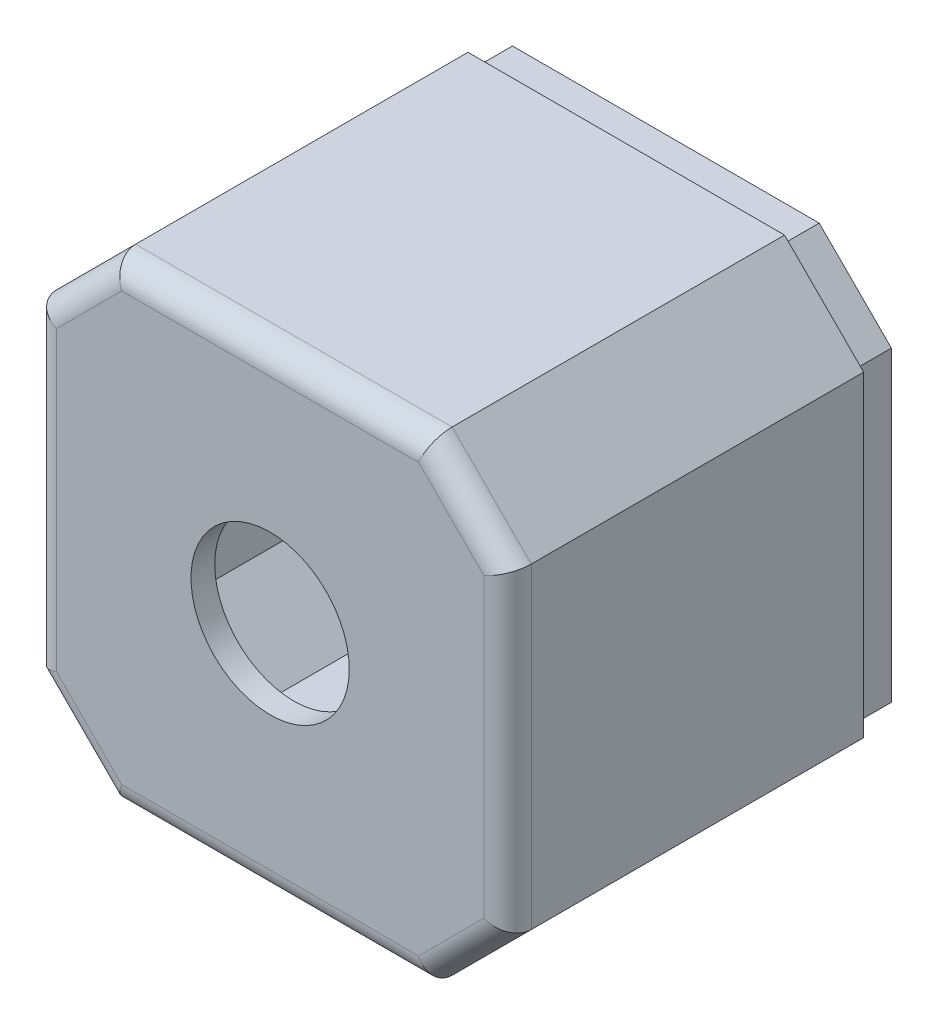
ISO-10303-21;
HEADER;
FILE_DESCRIPTION(('STEP AP214'),'2;1');
FILE_NAME('part.step','',(''),(''),'','','');
FILE_SCHEMA(('AUTOMOTIVE_DESIGN { 1 0 10303 214 1 1 1 1 }'));
ENDSEC;
DATA;
#1=APPLICATION_CONTEXT('core data for automotive mechanical design processes');
#2=APPLICATION_PROTOCOL_DEFINITION('international standard','automotive_design',2000,#1);
#3=PRODUCT_CONTEXT('',#1,'mechanical');
#4=PRODUCT('Part','Part','',(#3));
#5=PRODUCT_RELATED_PRODUCT_CATEGORY('part','',(#4));
#6=PRODUCT_DEFINITION_FORMATION('','',#4);
#7=PRODUCT_DEFINITION_CONTEXT('part definition',#1,'design');
#8=PRODUCT_DEFINITION('design','',#6,#7);
#9=PRODUCT_DEFINITION_SHAPE('','',#8);
#10=(LENGTH_UNIT() NAMED_UNIT(*) SI_UNIT(.MILLI.,.METRE.));
#11=(NAMED_UNIT(*) PLANE_ANGLE_UNIT() SI_UNIT($,.RADIAN.));
#12=(NAMED_UNIT(*) SI_UNIT($,.STERADIAN.) SOLID_ANGLE_UNIT());
#13=UNCERTAINTY_MEASURE_WITH_UNIT(LENGTH_MEASURE(1.E-05),#10,'distance_accuracy_value','');
#14=(GEOMETRIC_REPRESENTATION_CONTEXT(3) GLOBAL_UNCERTAINTY_ASSIGNED_CONTEXT((#13)) GLOBAL_UNIT_ASSIGNED_CONTEXT((#10,
#11,#12)) REPRESENTATION_CONTEXT('',''));
#15=CARTESIAN_POINT('',(0.,0.,0.));
#16=DIRECTION('',(0.,0.,1.));
#17=DIRECTION('',(1.,0.,0.));
#18=AXIS2_PLACEMENT_3D('',#15,#16,#17);
#19=CARTESIAN_POINT('',(0.,0.,0.));
#20=DIRECTION('',(0.,0.,-1.));
#21=DIRECTION('',(-1.,0.,0.));
#22=AXIS2_PLACEMENT_3D('',#19,#20,#21);
#23=PLANE('',#22);
#24=DIRECTION('',(-0.707106781186549,-0.707106781186546,0.));
#25=VECTOR('',#24,1.);
#26=CARTESIAN_POINT('',(-22.8786796564404,22.8786796564405,0.));
#27=LINE('',#26,#25);
#28=CARTESIAN_POINT('',(3.,48.7573593128807,0.));
#29=VERTEX_POINT('',#28);
#30=CARTESIAN_POINT('',(11.2426406871193,57.,0.));
#31=VERTEX_POINT('',#30);
#32=EDGE_CURVE('E369',#29,#31,#27,.F.);
#33=ORIENTED_EDGE('',*,*,#32,.F.);
#34=DIRECTION('',(0.,-1.,0.));
#35=VECTOR('',#34,1.);
#36=CARTESIAN_POINT('',(3.,0.,0.));
#37=LINE('',#36,#35);
#38=CARTESIAN_POINT('',(3.,11.2426406871193,0.));
#39=VERTEX_POINT('',#38);
#40=EDGE_CURVE('E324',#29,#39,#37,.T.);
#41=ORIENTED_EDGE('',*,*,#40,.T.);
#42=DIRECTION('',(0.707106781186546,-0.707106781186549,0.));
#43=VECTOR('',#42,1.);
#44=CARTESIAN_POINT('',(7.12132034355967,7.12132034355964,0.));
#45=LINE('',#44,#43);
#46=CARTESIAN_POINT('',(11.2426406871193,3.,0.));
#47=VERTEX_POINT('',#46);
#48=EDGE_CURVE('E375',#47,#39,#45,.F.);
#49=ORIENTED_EDGE('',*,*,#48,.F.);
#50=DIRECTION('',(1.,0.,0.));
#51=VECTOR('',#50,1.);
#52=CARTESIAN_POINT('',(0.,3.,0.));
#53=LINE('',#52,#51);
#54=CARTESIAN_POINT('',(48.7573593128807,3.,0.));
#55=VERTEX_POINT('',#54);
#56=EDGE_CURVE('E373',#47,#55,#53,.T.);
#57=ORIENTED_EDGE('',*,*,#56,.T.);
#58=DIRECTION('',(0.707106781186549,0.707106781186546,0.));
#59=VECTOR('',#58,1.);
#60=CARTESIAN_POINT('',(22.8786796564402,-22.8786796564403,0.));
#61=LINE('',#60,#59);
#62=CARTESIAN_POINT('',(57.,11.2426406871193,0.));
#63=VERTEX_POINT('',#62);
#64=EDGE_CURVE('E380',#63,#55,#61,.F.);
#65=ORIENTED_EDGE('',*,*,#64,.F.);
#66=DIRECTION('',(0.,1.,0.));
#67=VECTOR('',#66,1.);
#68=CARTESIAN_POINT('',(57.,0.,0.));
#69=LINE('',#68,#67);
#70=CARTESIAN_POINT('',(57.,48.7573593128807,0.));
#71=VERTEX_POINT('',#70);
#72=EDGE_CURVE('E378',#63,#71,#69,.T.);
#73=ORIENTED_EDGE('',*,*,#72,.T.);
#74=DIRECTION('',(-0.707106781186547,0.707106781186548,0.));
#75=VECTOR('',#74,1.);
#76=CARTESIAN_POINT('',(52.8786796564404,52.8786796564403,0.));
#77=LINE('',#76,#75);
#78=CARTESIAN_POINT('',(48.7573593128807,57.,0.));
#79=VERTEX_POINT('',#78);
#80=EDGE_CURVE('E337',#79,#71,#77,.F.);
#81=ORIENTED_EDGE('',*,*,#80,.F.);
#82=DIRECTION('',(-1.,0.,0.));
#83=VECTOR('',#82,1.);
#84=CARTESIAN_POINT('',(0.,57.,0.));
#85=LINE('',#84,#83);
#86=EDGE_CURVE('E331',#79,#31,#85,.T.);
#87=ORIENTED_EDGE('',*,*,#86,.T.);
#88=EDGE_LOOP('',(#33,#41,#49,#57,#65,#73,#81,#87));
#89=FACE_BOUND('',#88,.T.);
#90=DIRECTION('',(-1.,0.,0.));
#91=VECTOR('',#90,1.);
#92=CARTESIAN_POINT('',(49.3786796564403,1.5,0.));
#93=LINE('',#92,#91);
#94=CARTESIAN_POINT('',(49.3786796564403,1.5,0.));
#95=VERTEX_POINT('',#94);
#96=CARTESIAN_POINT('',(10.6213203435596,1.5,0.));
#97=VERTEX_POINT('',#96);
#98=EDGE_CURVE('E258',#95,#97,#93,.T.);
#99=ORIENTED_EDGE('',*,*,#98,.T.);
#100=DIRECTION('',(-0.707106781186546,0.707106781186549,0.));
#101=VECTOR('',#100,1.);
#102=CARTESIAN_POINT('',(10.6213203435596,1.5,0.));
#103=LINE('',#102,#101);
#104=CARTESIAN_POINT('',(1.5,10.6213203435597,0.));
#105=VERTEX_POINT('',#104);
#106=EDGE_CURVE('E278',#97,#105,#103,.T.);
#107=ORIENTED_EDGE('',*,*,#106,.T.);
#108=DIRECTION('',(0.,1.,0.));
#109=VECTOR('',#108,1.);
#110=CARTESIAN_POINT('',(1.5,10.6213203435597,0.));
#111=LINE('',#110,#109);
#112=CARTESIAN_POINT('',(1.5,49.3786796564404,0.));
#113=VERTEX_POINT('',#112);
#114=EDGE_CURVE('E238',#105,#113,#111,.T.);
#115=ORIENTED_EDGE('',*,*,#114,.T.);
#116=DIRECTION('',(0.707106781186549,0.707106781186546,0.));
#117=VECTOR('',#116,1.);
#118=CARTESIAN_POINT('',(1.5,49.3786796564404,0.));
#119=LINE('',#118,#117);
#120=CARTESIAN_POINT('',(10.6213203435597,58.5,0.));
#121=VERTEX_POINT('',#120);
#122=EDGE_CURVE('E63',#113,#121,#119,.T.);
#123=ORIENTED_EDGE('',*,*,#122,.T.);
#124=DIRECTION('',(1.,0.,0.));
#125=VECTOR('',#124,1.);
#126=CARTESIAN_POINT('',(10.6213203435597,58.5,0.));
#127=LINE('',#126,#125);
#128=CARTESIAN_POINT('',(49.3786796564404,58.5,0.));
#129=VERTEX_POINT('',#128);
#130=EDGE_CURVE('E282',#121,#129,#127,.T.);
#131=ORIENTED_EDGE('',*,*,#130,.T.);
#132=DIRECTION('',(0.707106781186547,-0.707106781186548,0.));
#133=VECTOR('',#132,1.);
#134=CARTESIAN_POINT('',(49.3786796564404,58.5,0.));
#135=LINE('',#134,#133);
#136=CARTESIAN_POINT('',(58.5,49.3786796564403,0.));
#137=VERTEX_POINT('',#136);
#138=EDGE_CURVE('E285',#129,#137,#135,.T.);
#139=ORIENTED_EDGE('',*,*,#138,.T.);
#140=DIRECTION('',(0.,-1.,0.));
#141=VECTOR('',#140,1.);
#142=CARTESIAN_POINT('',(58.5,49.3786796564403,0.));
#143=LINE('',#142,#141);
#144=CARTESIAN_POINT('',(58.5,10.6213203435596,0.));
#145=VERTEX_POINT('',#144);
#146=EDGE_CURVE('E288',#137,#145,#143,.T.);
#147=ORIENTED_EDGE('',*,*,#146,.T.);
#148=DIRECTION('',(-0.707106781186549,-0.707106781186546,0.));
#149=VECTOR('',#148,1.);
#150=CARTESIAN_POINT('',(58.5,10.6213203435596,0.));
#151=LINE('',#150,#149);
#152=EDGE_CURVE('E261',#145,#95,#151,.T.);
#153=ORIENTED_EDGE('',*,*,#152,.T.);
#154=EDGE_LOOP('',(#99,#107,#115,#123,#131,#139,#147,#153));
#155=FACE_BOUND('',#154,.T.);
#156=ADVANCED_FACE('F46',(#89,#155),#23,.T.);
#157=CARTESIAN_POINT('',(0.,0.,50.));
#158=DIRECTION('',(1.,0.,0.));
#159=DIRECTION('',(0.,0.,-1.));
#160=AXIS2_PLACEMENT_3D('',#157,#158,#159);
#161=PLANE('',#160);
#162=DIRECTION('',(0.,1.,0.));
#163=VECTOR('',#162,1.);
#164=CARTESIAN_POINT('',(0.,10.,5.));
#165=LINE('',#164,#163);
#166=CARTESIAN_POINT('',(0.,10.,5.));
#167=VERTEX_POINT('',#166);
#168=CARTESIAN_POINT('',(0.,50.,5.));
#169=VERTEX_POINT('',#168);
#170=EDGE_CURVE('E307',#167,#169,#165,.T.);
#171=ORIENTED_EDGE('',*,*,#170,.F.);
#172=DIRECTION('',(0.,0.,1.));
#173=VECTOR('',#172,1.);
#174=CARTESIAN_POINT('',(0.,10.,50.));
#175=LINE('',#174,#173);
#176=CARTESIAN_POINT('',(0.,10.,47.));
#177=VERTEX_POINT('',#176);
#178=EDGE_CURVE('E387',#167,#177,#175,.T.);
#179=ORIENTED_EDGE('',*,*,#178,.T.);
#180=DIRECTION('',(0.,-1.,0.));
#181=VECTOR('',#180,1.);
#182=CARTESIAN_POINT('',(0.,0.,47.));
#183=LINE('',#182,#181);
#184=CARTESIAN_POINT('',(0.,50.,47.));
#185=VERTEX_POINT('',#184);
#186=EDGE_CURVE('E13',#177,#185,#183,.F.);
#187=ORIENTED_EDGE('',*,*,#186,.T.);
#188=DIRECTION('',(0.,0.,-1.));
#189=VECTOR('',#188,1.);
#190=CARTESIAN_POINT('',(0.,50.,50.));
#191=LINE('',#190,#189);
#192=EDGE_CURVE('E389',#185,#169,#191,.T.);
#193=ORIENTED_EDGE('',*,*,#192,.T.);
#194=EDGE_LOOP('',(#171,#179,#187,#193));
#195=FACE_BOUND('',#194,.T.);
#196=ADVANCED_FACE('F528',(#195),#161,.F.);
#197=CARTESIAN_POINT('',(0.,0.,50.));
#198=DIRECTION('',(0.,1.,0.));
#199=DIRECTION('',(0.,0.,1.));
#200=AXIS2_PLACEMENT_3D('',#197,#198,#199);
#201=PLANE('',#200);
#202=DIRECTION('',(-1.,0.,0.));
#203=VECTOR('',#202,1.);
#204=CARTESIAN_POINT('',(50.,0.,5.));
#205=LINE('',#204,#203);
#206=CARTESIAN_POINT('',(50.,0.,5.));
#207=VERTEX_POINT('',#206);
#208=CARTESIAN_POINT('',(9.99999999999999,0.,5.));
#209=VERTEX_POINT('',#208);
#210=EDGE_CURVE('E318',#207,#209,#205,.T.);
#211=ORIENTED_EDGE('',*,*,#210,.F.);
#212=DIRECTION('',(0.,0.,1.));
#213=VECTOR('',#212,1.);
#214=CARTESIAN_POINT('',(50.,0.,50.));
#215=LINE('',#214,#213);
#216=CARTESIAN_POINT('',(50.,0.,47.));
#217=VERTEX_POINT('',#216);
#218=EDGE_CURVE('E397',#207,#217,#215,.T.);
#219=ORIENTED_EDGE('',*,*,#218,.T.);
#220=DIRECTION('',(1.,0.,0.));
#221=VECTOR('',#220,1.);
#222=CARTESIAN_POINT('',(0.,0.,47.));
#223=LINE('',#222,#221);
#224=CARTESIAN_POINT('',(9.99999999999999,0.,47.));
#225=VERTEX_POINT('',#224);
#226=EDGE_CURVE('E437',#217,#225,#223,.F.);
#227=ORIENTED_EDGE('',*,*,#226,.T.);
#228=DIRECTION('',(0.,0.,-1.));
#229=VECTOR('',#228,1.);
#230=CARTESIAN_POINT('',(9.99999999999999,0.,50.));
#231=LINE('',#230,#229);
#232=EDGE_CURVE('E399',#225,#209,#231,.T.);
#233=ORIENTED_EDGE('',*,*,#232,.T.);
#234=EDGE_LOOP('',(#211,#219,#227,#233));
#235=FACE_BOUND('',#234,.T.);
#236=ADVANCED_FACE('F512',(#235),#201,.F.);
#237=CARTESIAN_POINT('',(60.,0.,50.));
#238=DIRECTION('',(-1.,0.,0.));
#239=DIRECTION('',(0.,-1.,0.));
#240=AXIS2_PLACEMENT_3D('',#237,#238,#239);
#241=PLANE('',#240);
#242=DIRECTION('',(0.,-1.,0.));
#243=VECTOR('',#242,1.);
#244=CARTESIAN_POINT('',(60.,50.,5.));
#245=LINE('',#244,#243);
#246=CARTESIAN_POINT('',(60.,50.,5.));
#247=VERTEX_POINT('',#246);
#248=CARTESIAN_POINT('',(60.,10.,5.));
#249=VERTEX_POINT('',#248);
#250=EDGE_CURVE('E314',#247,#249,#245,.T.);
#251=ORIENTED_EDGE('',*,*,#250,.F.);
#252=DIRECTION('',(0.,0.,1.));
#253=VECTOR('',#252,1.);
#254=CARTESIAN_POINT('',(60.,50.,50.));
#255=LINE('',#254,#253);
#256=CARTESIAN_POINT('',(60.,50.,47.));
#257=VERTEX_POINT('',#256);
#258=EDGE_CURVE('E402',#247,#257,#255,.T.);
#259=ORIENTED_EDGE('',*,*,#258,.T.);
#260=DIRECTION('',(0.,1.,0.));
#261=VECTOR('',#260,1.);
#262=CARTESIAN_POINT('',(60.,0.,47.));
#263=LINE('',#262,#261);
#264=CARTESIAN_POINT('',(60.,10.,47.));
#265=VERTEX_POINT('',#264);
#266=EDGE_CURVE('E432',#257,#265,#263,.F.);
#267=ORIENTED_EDGE('',*,*,#266,.T.);
#268=DIRECTION('',(0.,0.,-1.));
#269=VECTOR('',#268,1.);
#270=CARTESIAN_POINT('',(60.,10.,50.));
#271=LINE('',#270,#269);
#272=EDGE_CURVE('E404',#265,#249,#271,.T.);
#273=ORIENTED_EDGE('',*,*,#272,.T.);
#274=EDGE_LOOP('',(#251,#259,#267,#273));
#275=FACE_BOUND('',#274,.T.);
#276=ADVANCED_FACE('F479',(#275),#241,.F.);
#277=CARTESIAN_POINT('',(0.,60.,50.));
#278=DIRECTION('',(0.,-1.,0.));
#279=DIRECTION('',(0.,0.,-1.));
#280=AXIS2_PLACEMENT_3D('',#277,#278,#279);
#281=PLANE('',#280);
#282=DIRECTION('',(1.,0.,0.));
#283=VECTOR('',#282,1.);
#284=CARTESIAN_POINT('',(10.,60.,5.));
#285=LINE('',#284,#283);
#286=CARTESIAN_POINT('',(10.,60.,5.));
#287=VERTEX_POINT('',#286);
#288=CARTESIAN_POINT('',(50.,60.,5.));
#289=VERTEX_POINT('',#288);
#290=EDGE_CURVE('E71',#287,#289,#285,.T.);
#291=ORIENTED_EDGE('',*,*,#290,.F.);
#292=DIRECTION('',(0.,0.,1.));
#293=VECTOR('',#292,1.);
#294=CARTESIAN_POINT('',(10.,60.,50.));
#295=LINE('',#294,#293);
#296=CARTESIAN_POINT('',(10.,60.,47.));
#297=VERTEX_POINT('',#296);
#298=EDGE_CURVE('E395',#287,#297,#295,.T.);
#299=ORIENTED_EDGE('',*,*,#298,.T.);
#300=DIRECTION('',(-1.,0.,0.));
#301=VECTOR('',#300,1.);
#302=CARTESIAN_POINT('',(0.,60.,47.));
#303=LINE('',#302,#301);
#304=CARTESIAN_POINT('',(50.,60.,47.));
#305=VERTEX_POINT('',#304);
#306=EDGE_CURVE('E427',#297,#305,#303,.F.);
#307=ORIENTED_EDGE('',*,*,#306,.T.);
#308=DIRECTION('',(0.,0.,-1.));
#309=VECTOR('',#308,1.);
#310=CARTESIAN_POINT('',(50.,60.,50.));
#311=LINE('',#310,#309);
#312=EDGE_CURVE('E392',#305,#289,#311,.T.);
#313=ORIENTED_EDGE('',*,*,#312,.T.);
#314=EDGE_LOOP('',(#291,#299,#307,#313));
#315=FACE_BOUND('',#314,.T.);
#316=ADVANCED_FACE('F515',(#315),#281,.F.);
#317=CARTESIAN_POINT('',(0.,50.,50.));
#318=DIRECTION('',(0.707106781186546,-0.707106781186549,0.));
#319=DIRECTION('',(0.,0.,-1.));
#320=AXIS2_PLACEMENT_3D('',#317,#318,#319);
#321=PLANE('',#320);
#322=ORIENTED_EDGE('',*,*,#298,.F.);
#323=DIRECTION('',(0.707106781186549,0.707106781186546,0.));
#324=VECTOR('',#323,1.);
#325=CARTESIAN_POINT('',(0.,50.,5.));
#326=LINE('',#325,#324);
#327=EDGE_CURVE('E309',#169,#287,#326,.T.);
#328=ORIENTED_EDGE('',*,*,#327,.F.);
#329=ORIENTED_EDGE('',*,*,#192,.F.);
#330=DIRECTION('',(-0.707106781186549,-0.707106781186546,0.));
#331=VECTOR('',#330,1.);
#332=CARTESIAN_POINT('',(10.,60.,47.));
#333=LINE('',#332,#331);
#334=EDGE_CURVE('E424',#185,#297,#333,.F.);
#335=ORIENTED_EDGE('',*,*,#334,.T.);
#336=EDGE_LOOP('',(#322,#328,#329,#335));
#337=FACE_BOUND('',#336,.T.);
#338=ADVANCED_FACE('F529',(#337),#321,.F.);
#339=CARTESIAN_POINT('',(9.99999999999999,0.,50.));
#340=DIRECTION('',(0.707106781186549,0.707106781186546,0.));
#341=DIRECTION('',(0.,0.,-1.));
#342=AXIS2_PLACEMENT_3D('',#339,#340,#341);
#343=PLANE('',#342);
#344=ORIENTED_EDGE('',*,*,#178,.F.);
#345=DIRECTION('',(-0.707106781186546,0.707106781186549,0.));
#346=VECTOR('',#345,1.);
#347=CARTESIAN_POINT('',(9.99999999999999,0.,5.));
#348=LINE('',#347,#346);
#349=EDGE_CURVE('E294',#209,#167,#348,.T.);
#350=ORIENTED_EDGE('',*,*,#349,.F.);
#351=ORIENTED_EDGE('',*,*,#232,.F.);
#352=DIRECTION('',(0.707106781186546,-0.707106781186549,0.));
#353=VECTOR('',#352,1.);
#354=CARTESIAN_POINT('',(0.,10.,47.));
#355=LINE('',#354,#353);
#356=EDGE_CURVE('E55',#225,#177,#355,.F.);
#357=ORIENTED_EDGE('',*,*,#356,.T.);
#358=EDGE_LOOP('',(#344,#350,#351,#357));
#359=FACE_BOUND('',#358,.T.);
#360=ADVANCED_FACE('F508',(#359),#343,.F.);
#361=CARTESIAN_POINT('',(60.,9.99999999999999,50.));
#362=DIRECTION('',(-0.707106781186546,0.707106781186549,0.));
#363=DIRECTION('',(0.,0.,-1.));
#364=AXIS2_PLACEMENT_3D('',#361,#362,#363);
#365=PLANE('',#364);
#366=ORIENTED_EDGE('',*,*,#218,.F.);
#367=DIRECTION('',(-0.707106781186549,-0.707106781186546,0.));
#368=VECTOR('',#367,1.);
#369=CARTESIAN_POINT('',(60.,10.,5.));
#370=LINE('',#369,#368);
#371=EDGE_CURVE('E316',#249,#207,#370,.T.);
#372=ORIENTED_EDGE('',*,*,#371,.F.);
#373=ORIENTED_EDGE('',*,*,#272,.F.);
#374=DIRECTION('',(0.707106781186549,0.707106781186546,0.));
#375=VECTOR('',#374,1.);
#376=CARTESIAN_POINT('',(50.,0.,47.));
#377=LINE('',#376,#375);
#378=EDGE_CURVE('E434',#265,#217,#377,.F.);
#379=ORIENTED_EDGE('',*,*,#378,.T.);
#380=EDGE_LOOP('',(#366,#372,#373,#379));
#381=FACE_BOUND('',#380,.T.);
#382=ADVANCED_FACE('F475',(#381),#365,.F.);
#383=CARTESIAN_POINT('',(50.,60.,50.));
#384=DIRECTION('',(-0.707106781186548,-0.707106781186547,0.));
#385=DIRECTION('',(0.,0.,-1.));
#386=AXIS2_PLACEMENT_3D('',#383,#384,#385);
#387=PLANE('',#386);
#388=ORIENTED_EDGE('',*,*,#258,.F.);
#389=DIRECTION('',(0.707106781186547,-0.707106781186548,0.));
#390=VECTOR('',#389,1.);
#391=CARTESIAN_POINT('',(50.,60.,5.));
#392=LINE('',#391,#390);
#393=EDGE_CURVE('E312',#289,#247,#392,.T.);
#394=ORIENTED_EDGE('',*,*,#393,.F.);
#395=ORIENTED_EDGE('',*,*,#312,.F.);
#396=DIRECTION('',(-0.707106781186547,0.707106781186548,0.));
#397=VECTOR('',#396,1.);
#398=CARTESIAN_POINT('',(60.,50.,47.));
#399=LINE('',#398,#397);
#400=EDGE_CURVE('E429',#305,#257,#399,.F.);
#401=ORIENTED_EDGE('',*,*,#400,.T.);
#402=EDGE_LOOP('',(#388,#394,#395,#401));
#403=FACE_BOUND('',#402,.T.);
#404=ADVANCED_FACE('F484',(#403),#387,.F.);
#405=CARTESIAN_POINT('',(0.,0.,50.));
#406=DIRECTION('',(0.,0.,-1.));
#407=DIRECTION('',(-1.,0.,0.));
#408=AXIS2_PLACEMENT_3D('',#405,#406,#407);
#409=PLANE('',#408);
#410=CARTESIAN_POINT('',(30.,30.,50.));
#411=DIRECTION('',(0.,0.,1.));
#412=DIRECTION('',(1.,0.,0.));
#413=AXIS2_PLACEMENT_3D('',#410,#411,#412);
#414=CIRCLE('',#413,10.);
#415=CARTESIAN_POINT('',(40.,30.,50.));
#416=VERTEX_POINT('',#415);
#417=EDGE_CURVE('E321',#416,#416,#414,.T.);
#418=ORIENTED_EDGE('',*,*,#417,.F.);
#419=EDGE_LOOP('',(#418));
#420=FACE_BOUND('',#419,.T.);
#421=DIRECTION('',(-1.,0.,0.));
#422=VECTOR('',#421,1.);
#423=CARTESIAN_POINT('',(0.,57.,50.));
#424=LINE('',#423,#422);
#425=CARTESIAN_POINT('',(48.7573593128807,57.,50.));
#426=VERTEX_POINT('',#425);
#427=CARTESIAN_POINT('',(11.2426406871193,57.,50.));
#428=VERTEX_POINT('',#427);
#429=EDGE_CURVE('E419',#426,#428,#424,.T.);
#430=ORIENTED_EDGE('',*,*,#429,.T.);
#431=DIRECTION('',(0.707106781186549,0.707106781186546,0.));
#432=VECTOR('',#431,1.);
#433=CARTESIAN_POINT('',(2.12132034355965,47.8786796564404,50.));
#434=LINE('',#433,#432);
#435=CARTESIAN_POINT('',(3.,48.7573593128807,50.));
#436=VERTEX_POINT('',#435);
#437=EDGE_CURVE('E421',#428,#436,#434,.F.);
#438=ORIENTED_EDGE('',*,*,#437,.T.);
#439=DIRECTION('',(0.,-1.,0.));
#440=VECTOR('',#439,1.);
#441=CARTESIAN_POINT('',(3.,0.,50.));
#442=LINE('',#441,#440);
#443=CARTESIAN_POINT('',(3.,11.2426406871193,50.));
#444=VERTEX_POINT('',#443);
#445=EDGE_CURVE('E407',#436,#444,#442,.T.);
#446=ORIENTED_EDGE('',*,*,#445,.T.);
#447=DIRECTION('',(-0.707106781186546,0.707106781186549,0.));
#448=VECTOR('',#447,1.);
#449=CARTESIAN_POINT('',(12.1213203435596,2.12132034355964,50.));
#450=LINE('',#449,#448);
#451=CARTESIAN_POINT('',(11.2426406871193,3.,50.));
#452=VERTEX_POINT('',#451);
#453=EDGE_CURVE('E409',#444,#452,#450,.F.);
#454=ORIENTED_EDGE('',*,*,#453,.T.);
#455=DIRECTION('',(1.,0.,0.));
#456=VECTOR('',#455,1.);
#457=CARTESIAN_POINT('',(0.,3.,50.));
#458=LINE('',#457,#456);
#459=CARTESIAN_POINT('',(48.7573593128807,3.,50.));
#460=VERTEX_POINT('',#459);
#461=EDGE_CURVE('E411',#452,#460,#458,.T.);
#462=ORIENTED_EDGE('',*,*,#461,.T.);
#463=DIRECTION('',(-0.707106781186549,-0.707106781186546,0.));
#464=VECTOR('',#463,1.);
#465=CARTESIAN_POINT('',(57.8786796564404,12.1213203435596,50.));
#466=LINE('',#465,#464);
#467=CARTESIAN_POINT('',(57.,11.2426406871193,50.));
#468=VERTEX_POINT('',#467);
#469=EDGE_CURVE('E413',#460,#468,#466,.F.);
#470=ORIENTED_EDGE('',*,*,#469,.T.);
#471=DIRECTION('',(0.,1.,0.));
#472=VECTOR('',#471,1.);
#473=CARTESIAN_POINT('',(57.,0.,50.));
#474=LINE('',#473,#472);
#475=CARTESIAN_POINT('',(57.,48.7573593128807,50.));
#476=VERTEX_POINT('',#475);
#477=EDGE_CURVE('E415',#468,#476,#474,.T.);
#478=ORIENTED_EDGE('',*,*,#477,.T.);
#479=DIRECTION('',(0.707106781186547,-0.707106781186548,0.));
#480=VECTOR('',#479,1.);
#481=CARTESIAN_POINT('',(47.8786796564403,57.8786796564404,50.));
#482=LINE('',#481,#480);
#483=EDGE_CURVE('E417',#476,#426,#482,.F.);
#484=ORIENTED_EDGE('',*,*,#483,.T.);
#485=EDGE_LOOP('',(#430,#438,#446,#454,#462,#470,#478,#484));
#486=FACE_BOUND('',#485,.T.);
#487=ADVANCED_FACE('F496',(#420,#486),#409,.F.);
#488=CARTESIAN_POINT('',(22.8786796564402,-22.8786796564403,47.));
#489=DIRECTION('',(0.707106781186549,0.707106781186546,0.));
#490=DIRECTION('',(-0.707106781186546,0.707106781186549,0.));
#491=AXIS2_PLACEMENT_3D('',#488,#489,#490);
#492=CYLINDRICAL_SURFACE('',#491,3.);
#493=CARTESIAN_POINT('',(48.7573593128807,3.,47.));
#494=DIRECTION('',(0.923879532511287,0.382683432365089,0.));
#495=DIRECTION('',(0.382683432365089,-0.923879532511287,0.));
#496=AXIS2_PLACEMENT_3D('',#493,#494,#495);
#497=ELLIPSE('',#496,3.24717660087718,3.);
#498=EDGE_CURVE('E456',#217,#460,#497,.F.);
#499=ORIENTED_EDGE('',*,*,#498,.F.);
#500=ORIENTED_EDGE('',*,*,#378,.F.);
#501=CARTESIAN_POINT('',(57.,11.2426406871193,47.));
#502=DIRECTION('',(0.382683432365091,0.923879532511286,0.));
#503=DIRECTION('',(0.923879532511287,-0.382683432365091,0.));
#504=AXIS2_PLACEMENT_3D('',#501,#502,#503);
#505=ELLIPSE('',#504,3.24717660087718,3.);
#506=EDGE_CURVE('E50',#468,#265,#505,.T.);
#507=ORIENTED_EDGE('',*,*,#506,.F.);
#508=ORIENTED_EDGE('',*,*,#469,.F.);
#509=EDGE_LOOP('',(#499,#500,#507,#508));
#510=FACE_BOUND('',#509,.T.);
#511=ADVANCED_FACE('F48',(#510),#492,.T.);
#512=CARTESIAN_POINT('',(57.,0.,47.));
#513=DIRECTION('',(0.,1.,0.));
#514=DIRECTION('',(-1.,0.,0.));
#515=AXIS2_PLACEMENT_3D('',#512,#513,#514);
#516=CYLINDRICAL_SURFACE('',#515,3.);
#517=ORIENTED_EDGE('',*,*,#506,.T.);
#518=ORIENTED_EDGE('',*,*,#266,.F.);
#519=CARTESIAN_POINT('',(57.,48.7573593128807,47.));
#520=DIRECTION('',(-0.38268343236509,0.923879532511287,0.));
#521=DIRECTION('',(0.923879532511287,0.38268343236509,0.));
#522=AXIS2_PLACEMENT_3D('',#519,#520,#521);
#523=ELLIPSE('',#522,3.24717660087718,3.);
#524=EDGE_CURVE('E454',#476,#257,#523,.T.);
#525=ORIENTED_EDGE('',*,*,#524,.F.);
#526=ORIENTED_EDGE('',*,*,#477,.F.);
#527=EDGE_LOOP('',(#517,#518,#525,#526));
#528=FACE_BOUND('',#527,.T.);
#529=ADVANCED_FACE('F467',(#528),#516,.T.);
#530=CARTESIAN_POINT('',(0.,3.,47.));
#531=DIRECTION('',(1.,0.,0.));
#532=DIRECTION('',(0.,0.,-1.));
#533=AXIS2_PLACEMENT_3D('',#530,#531,#532);
#534=CYLINDRICAL_SURFACE('',#533,3.);
#535=ORIENTED_EDGE('',*,*,#498,.T.);
#536=ORIENTED_EDGE('',*,*,#461,.F.);
#537=CARTESIAN_POINT('',(11.2426406871193,3.,47.));
#538=DIRECTION('',(0.923879532511286,-0.382683432365091,0.));
#539=DIRECTION('',(-0.382683432365091,-0.923879532511286,0.));
#540=AXIS2_PLACEMENT_3D('',#537,#538,#539);
#541=ELLIPSE('',#540,3.24717660087718,3.);
#542=EDGE_CURVE('E451',#225,#452,#541,.F.);
#543=ORIENTED_EDGE('',*,*,#542,.F.);
#544=ORIENTED_EDGE('',*,*,#226,.F.);
#545=EDGE_LOOP('',(#535,#536,#543,#544));
#546=FACE_BOUND('',#545,.T.);
#547=ADVANCED_FACE('F499',(#546),#534,.T.);
#548=CARTESIAN_POINT('',(52.8786796564404,52.8786796564403,47.));
#549=DIRECTION('',(-0.707106781186547,0.707106781186548,0.));
#550=DIRECTION('',(-0.707106781186548,-0.707106781186547,0.));
#551=AXIS2_PLACEMENT_3D('',#548,#549,#550);
#552=CYLINDRICAL_SURFACE('',#551,3.);
#553=ORIENTED_EDGE('',*,*,#524,.T.);
#554=ORIENTED_EDGE('',*,*,#400,.F.);
#555=CARTESIAN_POINT('',(48.7573593128807,57.,47.));
#556=DIRECTION('',(-0.923879532511287,0.38268343236509,0.));
#557=DIRECTION('',(0.38268343236509,0.923879532511287,0.));
#558=AXIS2_PLACEMENT_3D('',#555,#556,#557);
#559=ELLIPSE('',#558,3.24717660087718,3.);
#560=EDGE_CURVE('E448',#426,#305,#559,.T.);
#561=ORIENTED_EDGE('',*,*,#560,.F.);
#562=ORIENTED_EDGE('',*,*,#483,.F.);
#563=EDGE_LOOP('',(#553,#554,#561,#562));
#564=FACE_BOUND('',#563,.T.);
#565=ADVANCED_FACE('F487',(#564),#552,.T.);
#566=CARTESIAN_POINT('',(7.12132034355967,7.12132034355964,47.));
#567=DIRECTION('',(0.707106781186546,-0.707106781186549,0.));
#568=DIRECTION('',(0.707106781186549,0.707106781186546,0.));
#569=AXIS2_PLACEMENT_3D('',#566,#567,#568);
#570=CYLINDRICAL_SURFACE('',#569,3.);
#571=ORIENTED_EDGE('',*,*,#542,.T.);
#572=ORIENTED_EDGE('',*,*,#453,.F.);
#573=CARTESIAN_POINT('',(3.,11.2426406871193,47.));
#574=DIRECTION('',(0.382683432365089,-0.923879532511287,0.));
#575=DIRECTION('',(-0.923879532511287,-0.382683432365089,0.));
#576=AXIS2_PLACEMENT_3D('',#573,#574,#575);
#577=ELLIPSE('',#576,3.24717660087718,3.);
#578=EDGE_CURVE('E445',#177,#444,#577,.F.);
#579=ORIENTED_EDGE('',*,*,#578,.F.);
#580=ORIENTED_EDGE('',*,*,#356,.F.);
#581=EDGE_LOOP('',(#571,#572,#579,#580));
#582=FACE_BOUND('',#581,.T.);
#583=ADVANCED_FACE('F502',(#582),#570,.T.);
#584=CARTESIAN_POINT('',(0.,57.,47.));
#585=DIRECTION('',(-1.,0.,0.));
#586=DIRECTION('',(0.,0.,1.));
#587=AXIS2_PLACEMENT_3D('',#584,#585,#586);
#588=CYLINDRICAL_SURFACE('',#587,3.);
#589=ORIENTED_EDGE('',*,*,#560,.T.);
#590=ORIENTED_EDGE('',*,*,#306,.F.);
#591=CARTESIAN_POINT('',(11.2426406871193,57.,47.));
#592=DIRECTION('',(-0.923879532511287,-0.382683432365089,0.));
#593=DIRECTION('',(-0.382683432365089,0.923879532511287,0.));
#594=AXIS2_PLACEMENT_3D('',#591,#592,#593);
#595=ELLIPSE('',#594,3.24717660087718,3.);
#596=EDGE_CURVE('E442',#428,#297,#595,.T.);
#597=ORIENTED_EDGE('',*,*,#596,.F.);
#598=ORIENTED_EDGE('',*,*,#429,.F.);
#599=EDGE_LOOP('',(#589,#590,#597,#598));
#600=FACE_BOUND('',#599,.T.);
#601=ADVANCED_FACE('F492',(#600),#588,.T.);
#602=CARTESIAN_POINT('',(3.,0.,47.));
#603=DIRECTION('',(0.,-1.,0.));
#604=DIRECTION('',(0.,0.,-1.));
#605=AXIS2_PLACEMENT_3D('',#602,#603,#604);
#606=CYLINDRICAL_SURFACE('',#605,3.);
#607=ORIENTED_EDGE('',*,*,#578,.T.);
#608=ORIENTED_EDGE('',*,*,#445,.F.);
#609=CARTESIAN_POINT('',(3.,48.7573593128807,47.));
#610=DIRECTION('',(-0.382683432365091,-0.923879532511286,0.));
#611=DIRECTION('',(0.923879532511286,-0.382683432365091,0.));
#612=AXIS2_PLACEMENT_3D('',#609,#610,#611);
#613=ELLIPSE('',#612,3.24717660087718,3.);
#614=EDGE_CURVE('E351',#185,#436,#613,.F.);
#615=ORIENTED_EDGE('',*,*,#614,.F.);
#616=ORIENTED_EDGE('',*,*,#186,.F.);
#617=EDGE_LOOP('',(#607,#608,#615,#616));
#618=FACE_BOUND('',#617,.T.);
#619=ADVANCED_FACE('F525',(#618),#606,.T.);
#620=CARTESIAN_POINT('',(-22.8786796564404,22.8786796564405,47.));
#621=DIRECTION('',(-0.707106781186549,-0.707106781186546,0.));
#622=DIRECTION('',(0.707106781186546,-0.707106781186549,0.));
#623=AXIS2_PLACEMENT_3D('',#620,#621,#622);
#624=CYLINDRICAL_SURFACE('',#623,3.);
#625=ORIENTED_EDGE('',*,*,#596,.T.);
#626=ORIENTED_EDGE('',*,*,#334,.F.);
#627=ORIENTED_EDGE('',*,*,#614,.T.);
#628=ORIENTED_EDGE('',*,*,#437,.F.);
#629=EDGE_LOOP('',(#625,#626,#627,#628));
#630=FACE_BOUND('',#629,.T.);
#631=ADVANCED_FACE('F521',(#630),#624,.T.);
#632=CARTESIAN_POINT('',(3.,0.,50.));
#633=DIRECTION('',(1.,0.,0.));
#634=DIRECTION('',(0.,0.,-1.));
#635=AXIS2_PLACEMENT_3D('',#632,#633,#634);
#636=PLANE('',#635);
#637=DIRECTION('',(0.,0.,-1.));
#638=VECTOR('',#637,1.);
#639=CARTESIAN_POINT('',(3.,11.2426406871193,50.));
#640=LINE('',#639,#638);
#641=CARTESIAN_POINT('',(3.,11.2426406871193,47.));
#642=VERTEX_POINT('',#641);
#643=EDGE_CURVE('E327',#39,#642,#640,.F.);
#644=ORIENTED_EDGE('',*,*,#643,.F.);
#645=ORIENTED_EDGE('',*,*,#40,.F.);
#646=DIRECTION('',(0.,0.,1.));
#647=VECTOR('',#646,1.);
#648=CARTESIAN_POINT('',(3.,48.7573593128807,50.));
#649=LINE('',#648,#647);
#650=CARTESIAN_POINT('',(3.,48.7573593128807,47.));
#651=VERTEX_POINT('',#650);
#652=EDGE_CURVE('E330',#651,#29,#649,.F.);
#653=ORIENTED_EDGE('',*,*,#652,.F.);
#654=DIRECTION('',(0.,-1.,0.));
#655=VECTOR('',#654,1.);
#656=CARTESIAN_POINT('',(3.,0.,47.));
#657=LINE('',#656,#655);
#658=EDGE_CURVE('E332',#651,#642,#657,.T.);
#659=ORIENTED_EDGE('',*,*,#658,.T.);
#660=EDGE_LOOP('',(#644,#645,#653,#659));
#661=FACE_BOUND('',#660,.T.);
#662=ADVANCED_FACE('F687',(#661),#636,.T.);
#663=CARTESIAN_POINT('',(0.,3.,50.));
#664=DIRECTION('',(0.,1.,0.));
#665=DIRECTION('',(0.,0.,1.));
#666=AXIS2_PLACEMENT_3D('',#663,#664,#665);
#667=PLANE('',#666);
#668=DIRECTION('',(0.,0.,-1.));
#669=VECTOR('',#668,1.);
#670=CARTESIAN_POINT('',(48.7573593128807,3.,50.));
#671=LINE('',#670,#669);
#672=CARTESIAN_POINT('',(48.7573593128807,3.,47.));
#673=VERTEX_POINT('',#672);
#674=EDGE_CURVE('E357',#55,#673,#671,.F.);
#675=ORIENTED_EDGE('',*,*,#674,.F.);
#676=ORIENTED_EDGE('',*,*,#56,.F.);
#677=DIRECTION('',(0.,0.,1.));
#678=VECTOR('',#677,1.);
#679=CARTESIAN_POINT('',(11.2426406871193,3.,50.));
#680=LINE('',#679,#678);
#681=CARTESIAN_POINT('',(11.2426406871193,3.,47.));
#682=VERTEX_POINT('',#681);
#683=EDGE_CURVE('E360',#682,#47,#680,.F.);
#684=ORIENTED_EDGE('',*,*,#683,.F.);
#685=DIRECTION('',(1.,0.,0.));
#686=VECTOR('',#685,1.);
#687=CARTESIAN_POINT('',(0.,3.,47.));
#688=LINE('',#687,#686);
#689=EDGE_CURVE('E345',#682,#673,#688,.T.);
#690=ORIENTED_EDGE('',*,*,#689,.T.);
#691=EDGE_LOOP('',(#675,#676,#684,#690));
#692=FACE_BOUND('',#691,.T.);
#693=ADVANCED_FACE('F690',(#692),#667,.T.);
#694=CARTESIAN_POINT('',(57.,0.,50.));
#695=DIRECTION('',(-1.,0.,0.));
#696=DIRECTION('',(0.,-1.,0.));
#697=AXIS2_PLACEMENT_3D('',#694,#695,#696);
#698=PLANE('',#697);
#699=DIRECTION('',(0.,0.,-1.));
#700=VECTOR('',#699,1.);
#701=CARTESIAN_POINT('',(57.,48.7573593128807,50.));
#702=LINE('',#701,#700);
#703=CARTESIAN_POINT('',(57.,48.7573593128807,47.));
#704=VERTEX_POINT('',#703);
#705=EDGE_CURVE('E364',#71,#704,#702,.F.);
#706=ORIENTED_EDGE('',*,*,#705,.F.);
#707=ORIENTED_EDGE('',*,*,#72,.F.);
#708=DIRECTION('',(0.,0.,1.));
#709=VECTOR('',#708,1.);
#710=CARTESIAN_POINT('',(57.,11.2426406871193,50.));
#711=LINE('',#710,#709);
#712=CARTESIAN_POINT('',(57.,11.2426406871193,47.));
#713=VERTEX_POINT('',#712);
#714=EDGE_CURVE('E335',#713,#63,#711,.F.);
#715=ORIENTED_EDGE('',*,*,#714,.F.);
#716=DIRECTION('',(0.,-1.,0.));
#717=VECTOR('',#716,1.);
#718=CARTESIAN_POINT('',(57.,0.,47.));
#719=LINE('',#718,#717);
#720=EDGE_CURVE('E352',#704,#713,#719,.T.);
#721=ORIENTED_EDGE('',*,*,#720,.F.);
#722=EDGE_LOOP('',(#706,#707,#715,#721));
#723=FACE_BOUND('',#722,.T.);
#724=ADVANCED_FACE('F694',(#723),#698,.T.);
#725=CARTESIAN_POINT('',(0.,57.,50.));
#726=DIRECTION('',(0.,-1.,0.));
#727=DIRECTION('',(0.,0.,-1.));
#728=AXIS2_PLACEMENT_3D('',#725,#726,#727);
#729=PLANE('',#728);
#730=DIRECTION('',(0.,0.,-1.));
#731=VECTOR('',#730,1.);
#732=CARTESIAN_POINT('',(11.2426406871193,57.,50.));
#733=LINE('',#732,#731);
#734=CARTESIAN_POINT('',(11.2426406871193,57.,47.));
#735=VERTEX_POINT('',#734);
#736=EDGE_CURVE('E361',#31,#735,#733,.F.);
#737=ORIENTED_EDGE('',*,*,#736,.F.);
#738=ORIENTED_EDGE('',*,*,#86,.F.);
#739=DIRECTION('',(0.,0.,1.));
#740=VECTOR('',#739,1.);
#741=CARTESIAN_POINT('',(48.7573593128807,57.,50.));
#742=LINE('',#741,#740);
#743=CARTESIAN_POINT('',(48.7573593128807,57.,47.));
#744=VERTEX_POINT('',#743);
#745=EDGE_CURVE('E367',#744,#79,#742,.F.);
#746=ORIENTED_EDGE('',*,*,#745,.F.);
#747=DIRECTION('',(1.,0.,0.));
#748=VECTOR('',#747,1.);
#749=CARTESIAN_POINT('',(0.,57.,47.));
#750=LINE('',#749,#748);
#751=EDGE_CURVE('E338',#735,#744,#750,.T.);
#752=ORIENTED_EDGE('',*,*,#751,.F.);
#753=EDGE_LOOP('',(#737,#738,#746,#752));
#754=FACE_BOUND('',#753,.T.);
#755=ADVANCED_FACE('F698',(#754),#729,.T.);
#756=CARTESIAN_POINT('',(0.,0.,47.));
#757=DIRECTION('',(0.,0.,-1.));
#758=DIRECTION('',(-1.,0.,0.));
#759=AXIS2_PLACEMENT_3D('',#756,#757,#758);
#760=PLANE('',#759);
#761=CARTESIAN_POINT('',(30.,30.,47.));
#762=DIRECTION('',(0.,0.,-1.));
#763=DIRECTION('',(-1.,0.,0.));
#764=AXIS2_PLACEMENT_3D('',#761,#762,#763);
#765=CIRCLE('',#764,10.);
#766=CARTESIAN_POINT('',(20.,30.,47.));
#767=VERTEX_POINT('',#766);
#768=EDGE_CURVE('E320',#767,#767,#765,.F.);
#769=ORIENTED_EDGE('',*,*,#768,.T.);
#770=EDGE_LOOP('',(#769));
#771=FACE_BOUND('',#770,.T.);
#772=ORIENTED_EDGE('',*,*,#751,.T.);
#773=DIRECTION('',(-0.707106781186547,0.707106781186548,0.));
#774=VECTOR('',#773,1.);
#775=CARTESIAN_POINT('',(52.8786796564404,52.8786796564403,47.));
#776=LINE('',#775,#774);
#777=EDGE_CURVE('E341',#744,#704,#776,.F.);
#778=ORIENTED_EDGE('',*,*,#777,.T.);
#779=ORIENTED_EDGE('',*,*,#720,.T.);
#780=DIRECTION('',(0.707106781186549,0.707106781186546,0.));
#781=VECTOR('',#780,1.);
#782=CARTESIAN_POINT('',(22.8786796564402,-22.8786796564403,47.));
#783=LINE('',#782,#781);
#784=EDGE_CURVE('E348',#713,#673,#783,.F.);
#785=ORIENTED_EDGE('',*,*,#784,.T.);
#786=ORIENTED_EDGE('',*,*,#689,.F.);
#787=DIRECTION('',(-0.707106781186546,0.707106781186549,0.));
#788=VECTOR('',#787,1.);
#789=CARTESIAN_POINT('',(12.1213203435596,2.12132034355964,47.));
#790=LINE('',#789,#788);
#791=EDGE_CURVE('E334',#642,#682,#790,.F.);
#792=ORIENTED_EDGE('',*,*,#791,.F.);
#793=ORIENTED_EDGE('',*,*,#658,.F.);
#794=DIRECTION('',(-0.707106781186549,-0.707106781186546,0.));
#795=VECTOR('',#794,1.);
#796=CARTESIAN_POINT('',(-22.8786796564404,22.8786796564405,47.));
#797=LINE('',#796,#795);
#798=EDGE_CURVE('E342',#651,#735,#797,.F.);
#799=ORIENTED_EDGE('',*,*,#798,.T.);
#800=EDGE_LOOP('',(#772,#778,#779,#785,#786,#792,#793,#799));
#801=FACE_BOUND('',#800,.T.);
#802=ADVANCED_FACE('F702',(#771,#801),#760,.T.);
#803=CARTESIAN_POINT('',(2.12132034355964,47.8786796564404,50.));
#804=DIRECTION('',(0.707106781186546,-0.707106781186549,0.));
#805=DIRECTION('',(0.,0.,-1.));
#806=AXIS2_PLACEMENT_3D('',#803,#804,#805);
#807=PLANE('',#806);
#808=ORIENTED_EDGE('',*,*,#652,.T.);
#809=ORIENTED_EDGE('',*,*,#32,.T.);
#810=ORIENTED_EDGE('',*,*,#736,.T.);
#811=ORIENTED_EDGE('',*,*,#798,.F.);
#812=EDGE_LOOP('',(#808,#809,#810,#811));
#813=FACE_BOUND('',#812,.T.);
#814=ADVANCED_FACE('F706',(#813),#807,.T.);
#815=CARTESIAN_POINT('',(12.1213203435596,2.12132034355964,50.));
#816=DIRECTION('',(0.707106781186549,0.707106781186546,0.));
#817=DIRECTION('',(0.,0.,-1.));
#818=AXIS2_PLACEMENT_3D('',#815,#816,#817);
#819=PLANE('',#818);
#820=ORIENTED_EDGE('',*,*,#683,.T.);
#821=ORIENTED_EDGE('',*,*,#48,.T.);
#822=ORIENTED_EDGE('',*,*,#643,.T.);
#823=ORIENTED_EDGE('',*,*,#791,.T.);
#824=EDGE_LOOP('',(#820,#821,#822,#823));
#825=FACE_BOUND('',#824,.T.);
#826=ADVANCED_FACE('F710',(#825),#819,.T.);
#827=CARTESIAN_POINT('',(57.8786796564404,12.1213203435596,50.));
#828=DIRECTION('',(-0.707106781186546,0.707106781186549,0.));
#829=DIRECTION('',(0.,0.,-1.));
#830=AXIS2_PLACEMENT_3D('',#827,#828,#829);
#831=PLANE('',#830);
#832=ORIENTED_EDGE('',*,*,#714,.T.);
#833=ORIENTED_EDGE('',*,*,#64,.T.);
#834=ORIENTED_EDGE('',*,*,#674,.T.);
#835=ORIENTED_EDGE('',*,*,#784,.F.);
#836=EDGE_LOOP('',(#832,#833,#834,#835));
#837=FACE_BOUND('',#836,.T.);
#838=ADVANCED_FACE('F714',(#837),#831,.T.);
#839=CARTESIAN_POINT('',(47.8786796564404,57.8786796564404,50.));
#840=DIRECTION('',(-0.707106781186548,-0.707106781186547,0.));
#841=DIRECTION('',(0.,0.,-1.));
#842=AXIS2_PLACEMENT_3D('',#839,#840,#841);
#843=PLANE('',#842);
#844=ORIENTED_EDGE('',*,*,#745,.T.);
#845=ORIENTED_EDGE('',*,*,#80,.T.);
#846=ORIENTED_EDGE('',*,*,#705,.T.);
#847=ORIENTED_EDGE('',*,*,#777,.F.);
#848=EDGE_LOOP('',(#844,#845,#846,#847));
#849=FACE_BOUND('',#848,.T.);
#850=ADVANCED_FACE('F685',(#849),#843,.T.);
#851=CARTESIAN_POINT('',(30.,30.,-0.001000000000001));
#852=DIRECTION('',(0.,0.,1.));
#853=DIRECTION('',(1.,0.,0.));
#854=AXIS2_PLACEMENT_3D('',#851,#852,#853);
#855=CYLINDRICAL_SURFACE('',#854,10.);
#856=ORIENTED_EDGE('',*,*,#768,.F.);
#857=EDGE_LOOP('',(#856));
#858=FACE_BOUND('',#857,.T.);
#859=ORIENTED_EDGE('',*,*,#417,.T.);
#860=EDGE_LOOP('',(#859));
#861=FACE_BOUND('',#860,.T.);
#862=ADVANCED_FACE('F602',(#858,#861),#855,.F.);
#863=CARTESIAN_POINT('',(0.,0.,5.));
#864=DIRECTION('',(0.,0.,-1.));
#865=DIRECTION('',(-1.,0.,0.));
#866=AXIS2_PLACEMENT_3D('',#863,#864,#865);
#867=PLANE('',#866);
#868=DIRECTION('',(-1.,0.,0.));
#869=VECTOR('',#868,1.);
#870=CARTESIAN_POINT('',(49.3786796564403,1.5,5.));
#871=LINE('',#870,#869);
#872=CARTESIAN_POINT('',(49.3786796564403,1.5,5.));
#873=VERTEX_POINT('',#872);
#874=CARTESIAN_POINT('',(10.6213203435596,1.5,5.));
#875=VERTEX_POINT('',#874);
#876=EDGE_CURVE('E244',#873,#875,#871,.T.);
#877=ORIENTED_EDGE('',*,*,#876,.F.);
#878=DIRECTION('',(-0.707106781186549,-0.707106781186546,0.));
#879=VECTOR('',#878,1.);
#880=CARTESIAN_POINT('',(58.5,10.6213203435596,5.));
#881=LINE('',#880,#879);
#882=CARTESIAN_POINT('',(58.5,10.6213203435596,5.));
#883=VERTEX_POINT('',#882);
#884=EDGE_CURVE('E274',#883,#873,#881,.T.);
#885=ORIENTED_EDGE('',*,*,#884,.F.);
#886=DIRECTION('',(0.,-1.,0.));
#887=VECTOR('',#886,1.);
#888=CARTESIAN_POINT('',(58.5,49.3786796564403,5.));
#889=LINE('',#888,#887);
#890=CARTESIAN_POINT('',(58.5,49.3786796564403,5.));
#891=VERTEX_POINT('',#890);
#892=EDGE_CURVE('E271',#891,#883,#889,.T.);
#893=ORIENTED_EDGE('',*,*,#892,.F.);
#894=DIRECTION('',(0.707106781186547,-0.707106781186548,0.));
#895=VECTOR('',#894,1.);
#896=CARTESIAN_POINT('',(49.3786796564404,58.5,5.));
#897=LINE('',#896,#895);
#898=CARTESIAN_POINT('',(49.3786796564404,58.5,5.));
#899=VERTEX_POINT('',#898);
#900=EDGE_CURVE('E268',#899,#891,#897,.T.);
#901=ORIENTED_EDGE('',*,*,#900,.F.);
#902=DIRECTION('',(1.,0.,0.));
#903=VECTOR('',#902,1.);
#904=CARTESIAN_POINT('',(10.6213203435597,58.5,5.));
#905=LINE('',#904,#903);
#906=CARTESIAN_POINT('',(10.6213203435597,58.5,5.));
#907=VERTEX_POINT('',#906);
#908=EDGE_CURVE('E265',#907,#899,#905,.T.);
#909=ORIENTED_EDGE('',*,*,#908,.F.);
#910=DIRECTION('',(0.707106781186549,0.707106781186546,0.));
#911=VECTOR('',#910,1.);
#912=CARTESIAN_POINT('',(1.5,49.3786796564404,5.));
#913=LINE('',#912,#911);
#914=CARTESIAN_POINT('',(1.5,49.3786796564404,5.));
#915=VERTEX_POINT('',#914);
#916=EDGE_CURVE('E254',#915,#907,#913,.T.);
#917=ORIENTED_EDGE('',*,*,#916,.F.);
#918=DIRECTION('',(0.,1.,0.));
#919=VECTOR('',#918,1.);
#920=CARTESIAN_POINT('',(1.5,10.6213203435597,5.));
#921=LINE('',#920,#919);
#922=CARTESIAN_POINT('',(1.5,10.6213203435597,5.));
#923=VERTEX_POINT('',#922);
#924=EDGE_CURVE('E236',#923,#915,#921,.T.);
#925=ORIENTED_EDGE('',*,*,#924,.F.);
#926=DIRECTION('',(-0.707106781186546,0.707106781186549,0.));
#927=VECTOR('',#926,1.);
#928=CARTESIAN_POINT('',(10.6213203435596,1.5,5.));
#929=LINE('',#928,#927);
#930=EDGE_CURVE('E250',#875,#923,#929,.T.);
#931=ORIENTED_EDGE('',*,*,#930,.F.);
#932=EDGE_LOOP('',(#877,#885,#893,#901,#909,#917,#925,#931));
#933=FACE_BOUND('',#932,.T.);
#934=ORIENTED_EDGE('',*,*,#349,.T.);
#935=ORIENTED_EDGE('',*,*,#170,.T.);
#936=ORIENTED_EDGE('',*,*,#327,.T.);
#937=ORIENTED_EDGE('',*,*,#290,.T.);
#938=ORIENTED_EDGE('',*,*,#393,.T.);
#939=ORIENTED_EDGE('',*,*,#250,.T.);
#940=ORIENTED_EDGE('',*,*,#371,.T.);
#941=ORIENTED_EDGE('',*,*,#210,.T.);
#942=EDGE_LOOP('',(#934,#935,#936,#937,#938,#939,#940,#941));
#943=FACE_BOUND('',#942,.T.);
#944=ADVANCED_FACE('F249',(#933,#943),#867,.T.);
#945=CARTESIAN_POINT('',(10.6213203435596,1.5,5.));
#946=DIRECTION('',(-0.707106781186549,-0.707106781186546,0.));
#947=DIRECTION('',(0.707106781186546,-0.707106781186549,0.));
#948=AXIS2_PLACEMENT_3D('',#945,#946,#947);
#949=PLANE('',#948);
#950=ORIENTED_EDGE('',*,*,#106,.F.);
#951=DIRECTION('',(0.,0.,-1.));
#952=VECTOR('',#951,1.);
#953=CARTESIAN_POINT('',(10.6213203435596,1.5,5.));
#954=LINE('',#953,#952);
#955=EDGE_CURVE('E257',#875,#97,#954,.T.);
#956=ORIENTED_EDGE('',*,*,#955,.F.);
#957=ORIENTED_EDGE('',*,*,#930,.T.);
#958=DIRECTION('',(0.,0.,-1.));
#959=VECTOR('',#958,1.);
#960=CARTESIAN_POINT('',(1.5,10.6213203435597,5.));
#961=LINE('',#960,#959);
#962=EDGE_CURVE('E233',#923,#105,#961,.T.);
#963=ORIENTED_EDGE('',*,*,#962,.T.);
#964=EDGE_LOOP('',(#950,#956,#957,#963));
#965=FACE_BOUND('',#964,.T.);
#966=ADVANCED_FACE('F256',(#965),#949,.T.);
#967=CARTESIAN_POINT('',(49.3786796564403,1.5,5.));
#968=DIRECTION('',(0.,-1.,0.));
#969=DIRECTION('',(0.,0.,-1.));
#970=AXIS2_PLACEMENT_3D('',#967,#968,#969);
#971=PLANE('',#970);
#972=ORIENTED_EDGE('',*,*,#98,.F.);
#973=DIRECTION('',(0.,0.,-1.));
#974=VECTOR('',#973,1.);
#975=CARTESIAN_POINT('',(49.3786796564403,1.5,5.));
#976=LINE('',#975,#974);
#977=EDGE_CURVE('E295',#873,#95,#976,.T.);
#978=ORIENTED_EDGE('',*,*,#977,.F.);
#979=ORIENTED_EDGE('',*,*,#876,.T.);
#980=ORIENTED_EDGE('',*,*,#955,.T.);
#981=EDGE_LOOP('',(#972,#978,#979,#980));
#982=FACE_BOUND('',#981,.T.);
#983=ADVANCED_FACE('F613',(#982),#971,.T.);
#984=CARTESIAN_POINT('',(58.5,10.6213203435596,5.));
#985=DIRECTION('',(0.707106781186546,-0.707106781186549,0.));
#986=DIRECTION('',(0.707106781186549,0.707106781186546,0.));
#987=AXIS2_PLACEMENT_3D('',#984,#985,#986);
#988=PLANE('',#987);
#989=ORIENTED_EDGE('',*,*,#152,.F.);
#990=DIRECTION('',(0.,0.,-1.));
#991=VECTOR('',#990,1.);
#992=CARTESIAN_POINT('',(58.5,10.6213203435596,5.));
#993=LINE('',#992,#991);
#994=EDGE_CURVE('E297',#883,#145,#993,.T.);
#995=ORIENTED_EDGE('',*,*,#994,.F.);
#996=ORIENTED_EDGE('',*,*,#884,.T.);
#997=ORIENTED_EDGE('',*,*,#977,.T.);
#998=EDGE_LOOP('',(#989,#995,#996,#997));
#999=FACE_BOUND('',#998,.T.);
#1000=ADVANCED_FACE('F622',(#999),#988,.T.);
#1001=CARTESIAN_POINT('',(58.5,49.3786796564403,5.));
#1002=DIRECTION('',(1.,0.,0.));
#1003=DIRECTION('',(0.,1.,0.));
#1004=AXIS2_PLACEMENT_3D('',#1001,#1002,#1003);
#1005=PLANE('',#1004);
#1006=ORIENTED_EDGE('',*,*,#146,.F.);
#1007=DIRECTION('',(0.,0.,-1.));
#1008=VECTOR('',#1007,1.);
#1009=CARTESIAN_POINT('',(58.5,49.3786796564403,5.));
#1010=LINE('',#1009,#1008);
#1011=EDGE_CURVE('E299',#891,#137,#1010,.T.);
#1012=ORIENTED_EDGE('',*,*,#1011,.F.);
#1013=ORIENTED_EDGE('',*,*,#892,.T.);
#1014=ORIENTED_EDGE('',*,*,#994,.T.);
#1015=EDGE_LOOP('',(#1006,#1012,#1013,#1014));
#1016=FACE_BOUND('',#1015,.T.);
#1017=ADVANCED_FACE('F632',(#1016),#1005,.T.);
#1018=CARTESIAN_POINT('',(49.3786796564404,58.5,5.));
#1019=DIRECTION('',(0.707106781186548,0.707106781186547,0.));
#1020=DIRECTION('',(-0.707106781186547,0.707106781186548,0.));
#1021=AXIS2_PLACEMENT_3D('',#1018,#1019,#1020);
#1022=PLANE('',#1021);
#1023=ORIENTED_EDGE('',*,*,#138,.F.);
#1024=DIRECTION('',(0.,0.,-1.));
#1025=VECTOR('',#1024,1.);
#1026=CARTESIAN_POINT('',(49.3786796564404,58.5,5.));
#1027=LINE('',#1026,#1025);
#1028=EDGE_CURVE('E301',#899,#129,#1027,.T.);
#1029=ORIENTED_EDGE('',*,*,#1028,.F.);
#1030=ORIENTED_EDGE('',*,*,#900,.T.);
#1031=ORIENTED_EDGE('',*,*,#1011,.T.);
#1032=EDGE_LOOP('',(#1023,#1029,#1030,#1031));
#1033=FACE_BOUND('',#1032,.T.);
#1034=ADVANCED_FACE('F642',(#1033),#1022,.T.);
#1035=CARTESIAN_POINT('',(10.6213203435597,58.5,5.));
#1036=DIRECTION('',(0.,1.,0.));
#1037=DIRECTION('',(0.,0.,1.));
#1038=AXIS2_PLACEMENT_3D('',#1035,#1036,#1037);
#1039=PLANE('',#1038);
#1040=ORIENTED_EDGE('',*,*,#130,.F.);
#1041=DIRECTION('',(0.,0.,-1.));
#1042=VECTOR('',#1041,1.);
#1043=CARTESIAN_POINT('',(10.6213203435597,58.5,5.));
#1044=LINE('',#1043,#1042);
#1045=EDGE_CURVE('E303',#907,#121,#1044,.T.);
#1046=ORIENTED_EDGE('',*,*,#1045,.F.);
#1047=ORIENTED_EDGE('',*,*,#908,.T.);
#1048=ORIENTED_EDGE('',*,*,#1028,.T.);
#1049=EDGE_LOOP('',(#1040,#1046,#1047,#1048));
#1050=FACE_BOUND('',#1049,.T.);
#1051=ADVANCED_FACE('F652',(#1050),#1039,.T.);
#1052=CARTESIAN_POINT('',(1.5,49.3786796564404,5.));
#1053=DIRECTION('',(-0.707106781186546,0.707106781186549,0.));
#1054=DIRECTION('',(-0.707106781186549,-0.707106781186546,0.));
#1055=AXIS2_PLACEMENT_3D('',#1052,#1053,#1054);
#1056=PLANE('',#1055);
#1057=ORIENTED_EDGE('',*,*,#122,.F.);
#1058=DIRECTION('',(0.,0.,-1.));
#1059=VECTOR('',#1058,1.);
#1060=CARTESIAN_POINT('',(1.5,49.3786796564404,5.));
#1061=LINE('',#1060,#1059);
#1062=EDGE_CURVE('E243',#915,#113,#1061,.T.);
#1063=ORIENTED_EDGE('',*,*,#1062,.F.);
#1064=ORIENTED_EDGE('',*,*,#916,.T.);
#1065=ORIENTED_EDGE('',*,*,#1045,.T.);
#1066=EDGE_LOOP('',(#1057,#1063,#1064,#1065));
#1067=FACE_BOUND('',#1066,.T.);
#1068=ADVANCED_FACE('F662',(#1067),#1056,.T.);
#1069=CARTESIAN_POINT('',(1.5,10.6213203435597,5.));
#1070=DIRECTION('',(-1.,0.,0.));
#1071=DIRECTION('',(0.,0.,1.));
#1072=AXIS2_PLACEMENT_3D('',#1069,#1070,#1071);
#1073=PLANE('',#1072);
#1074=ORIENTED_EDGE('',*,*,#114,.F.);
#1075=ORIENTED_EDGE('',*,*,#962,.F.);
#1076=ORIENTED_EDGE('',*,*,#924,.T.);
#1077=ORIENTED_EDGE('',*,*,#1062,.T.);
#1078=EDGE_LOOP('',(#1074,#1075,#1076,#1077));
#1079=FACE_BOUND('',#1078,.T.);
#1080=ADVANCED_FACE('F235',(#1079),#1073,.T.);
#1081=CLOSED_SHELL('',(#156,#196,#236,#276,#316,#338,#360,#382,#404,#487,#511,#529,#547,#565,
#583,#601,#619,#631,#662,#693,#724,#755,#802,#814,#826,#838,#850,#862,#944,#966,#983,#1000,
#1017,#1034,#1051,#1068,#1080));
#1082=MANIFOLD_SOLID_BREP('B2',#1081);
#1083=ADVANCED_BREP_SHAPE_REPRESENTATION('',(#18,#1082),#14);
#1084=SHAPE_DEFINITION_REPRESENTATION(#9,#1083);
ENDSEC;
END-ISO-10303-21;
